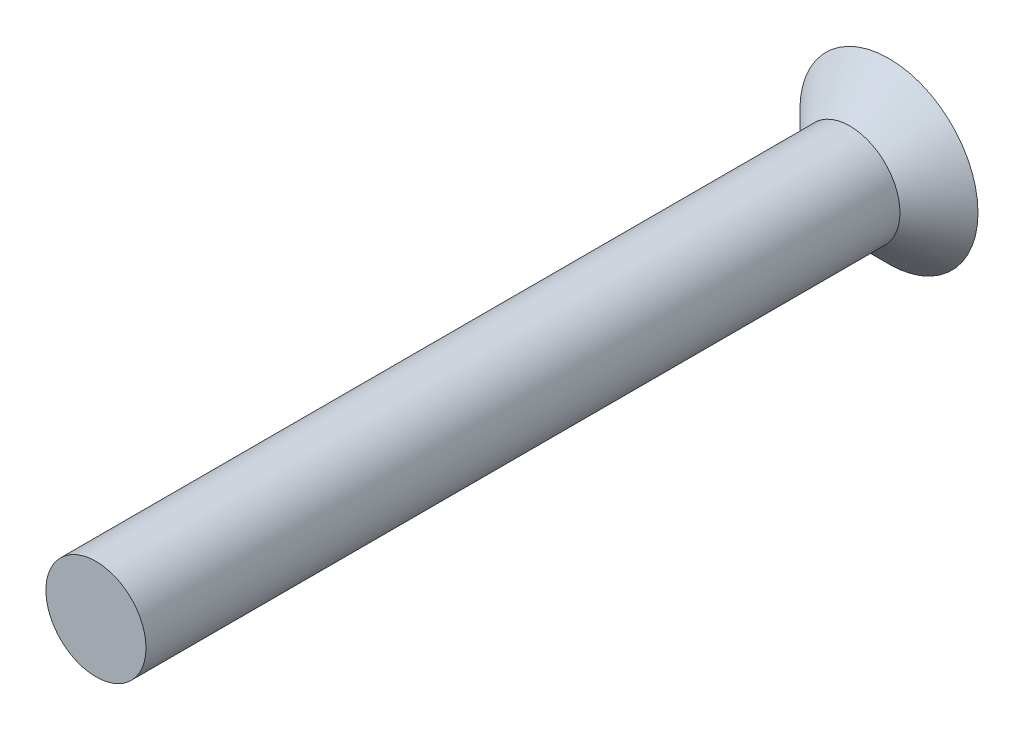
ISO-10303-21;
HEADER;
FILE_DESCRIPTION(('STEP AP214'),'2;1');
FILE_NAME('part.step','',(''),(''),'','','');
FILE_SCHEMA(('AUTOMOTIVE_DESIGN { 1 0 10303 214 1 1 1 1 }'));
ENDSEC;
DATA;
#1=APPLICATION_CONTEXT('core data for automotive mechanical design processes');
#2=APPLICATION_PROTOCOL_DEFINITION('international standard','automotive_design',2000,#1);
#3=PRODUCT_CONTEXT('',#1,'mechanical');
#4=PRODUCT('Part','Part','',(#3));
#5=PRODUCT_RELATED_PRODUCT_CATEGORY('part','',(#4));
#6=PRODUCT_DEFINITION_FORMATION('','',#4);
#7=PRODUCT_DEFINITION_CONTEXT('part definition',#1,'design');
#8=PRODUCT_DEFINITION('design','',#6,#7);
#9=PRODUCT_DEFINITION_SHAPE('','',#8);
#10=(LENGTH_UNIT() NAMED_UNIT(*) SI_UNIT(.MILLI.,.METRE.));
#11=(NAMED_UNIT(*) PLANE_ANGLE_UNIT() SI_UNIT($,.RADIAN.));
#12=(NAMED_UNIT(*) SI_UNIT($,.STERADIAN.) SOLID_ANGLE_UNIT());
#13=UNCERTAINTY_MEASURE_WITH_UNIT(LENGTH_MEASURE(1.E-05),#10,'distance_accuracy_value','');
#14=(GEOMETRIC_REPRESENTATION_CONTEXT(3) GLOBAL_UNCERTAINTY_ASSIGNED_CONTEXT((#13)) GLOBAL_UNIT_ASSIGNED_CONTEXT((#10,
#11,#12)) REPRESENTATION_CONTEXT('',''));
#15=CARTESIAN_POINT('',(0.,0.,0.));
#16=DIRECTION('',(0.,0.,1.));
#17=DIRECTION('',(1.,0.,0.));
#18=AXIS2_PLACEMENT_3D('',#15,#16,#17);
#19=CARTESIAN_POINT('',(15.5,-15.5,-19.2208));
#20=DIRECTION('',(0.,0.,1.));
#21=DIRECTION('',(1.,0.,0.));
#22=AXIS2_PLACEMENT_3D('',#19,#20,#21);
#23=PLANE('',#22);
#24=CARTESIAN_POINT('',(14.7888,-16.2112,-19.2208));
#25=DIRECTION('',(0.,0.,1.));
#26=DIRECTION('',(1.,0.,0.));
#27=AXIS2_PLACEMENT_3D('',#24,#25,#26);
#28=CIRCLE('',#27,0.508);
#29=CARTESIAN_POINT('',(15.0174,-15.7575414940729,-19.2208));
#30=VERTEX_POINT('',#29);
#31=CARTESIAN_POINT('',(15.2424585059271,-15.9826,-19.2208));
#32=VERTEX_POINT('',#31);
#33=EDGE_CURVE('E188',#30,#32,#28,.F.);
#34=ORIENTED_EDGE('',*,*,#33,.F.);
#35=DIRECTION('',(0.,1.,0.));
#36=VECTOR('',#35,1.);
#37=CARTESIAN_POINT('',(15.0174,-15.5,-19.2208));
#38=LINE('',#37,#36);
#39=CARTESIAN_POINT('',(15.0174,-15.2424585059271,-19.2208));
#40=VERTEX_POINT('',#39);
#41=EDGE_CURVE('E209',#30,#40,#38,.T.);
#42=ORIENTED_EDGE('',*,*,#41,.T.);
#43=CARTESIAN_POINT('',(14.7888,-14.7888,-19.2208));
#44=DIRECTION('',(0.,0.,-1.));
#45=DIRECTION('',(-1.,0.,0.));
#46=AXIS2_PLACEMENT_3D('',#43,#44,#45);
#47=CIRCLE('',#46,0.508);
#48=CARTESIAN_POINT('',(15.2424585059271,-15.0174,-19.2208));
#49=VERTEX_POINT('',#48);
#50=EDGE_CURVE('E213',#49,#40,#47,.T.);
#51=ORIENTED_EDGE('',*,*,#50,.F.);
#52=DIRECTION('',(1.,0.,0.));
#53=VECTOR('',#52,1.);
#54=CARTESIAN_POINT('',(15.5,-15.0174,-19.2208));
#55=LINE('',#54,#53);
#56=CARTESIAN_POINT('',(15.7575414940729,-15.0174,-19.2208));
#57=VERTEX_POINT('',#56);
#58=EDGE_CURVE('E135',#49,#57,#55,.T.);
#59=ORIENTED_EDGE('',*,*,#58,.T.);
#60=CARTESIAN_POINT('',(16.2112,-14.7888,-19.2208));
#61=DIRECTION('',(0.,0.,1.));
#62=DIRECTION('',(1.,0.,0.));
#63=AXIS2_PLACEMENT_3D('',#60,#61,#62);
#64=CIRCLE('',#63,0.508);
#65=CARTESIAN_POINT('',(15.9826,-15.2424585059271,-19.2208));
#66=VERTEX_POINT('',#65);
#67=EDGE_CURVE('E20',#66,#57,#64,.F.);
#68=ORIENTED_EDGE('',*,*,#67,.F.);
#69=DIRECTION('',(0.,1.,0.));
#70=VECTOR('',#69,1.);
#71=CARTESIAN_POINT('',(15.9826,-15.5,-19.2208));
#72=LINE('',#71,#70);
#73=CARTESIAN_POINT('',(15.9826,-15.7575414940729,-19.2208));
#74=VERTEX_POINT('',#73);
#75=EDGE_CURVE('E132',#66,#74,#72,.F.);
#76=ORIENTED_EDGE('',*,*,#75,.T.);
#77=CARTESIAN_POINT('',(16.2112,-16.2112,-19.2208));
#78=DIRECTION('',(0.,0.,-1.));
#79=DIRECTION('',(-1.,0.,0.));
#80=AXIS2_PLACEMENT_3D('',#77,#78,#79);
#81=CIRCLE('',#80,0.508);
#82=CARTESIAN_POINT('',(15.7575414940729,-15.9826,-19.2208));
#83=VERTEX_POINT('',#82);
#84=EDGE_CURVE('E161',#83,#74,#81,.T.);
#85=ORIENTED_EDGE('',*,*,#84,.F.);
#86=DIRECTION('',(1.,0.,0.));
#87=VECTOR('',#86,1.);
#88=CARTESIAN_POINT('',(15.5,-15.9826,-19.2208));
#89=LINE('',#88,#87);
#90=EDGE_CURVE('E168',#83,#32,#89,.F.);
#91=ORIENTED_EDGE('',*,*,#90,.T.);
#92=EDGE_LOOP('',(#34,#42,#51,#59,#68,#76,#85,#91));
#93=FACE_BOUND('',#92,.T.);
#94=ADVANCED_FACE('F17',(#93),#23,.F.);
#95=CARTESIAN_POINT('',(16.2112,-14.7888,-19.8520736083459));
#96=DIRECTION('',(0.,0.,1.));
#97=DIRECTION('',(1.,0.,0.));
#98=AXIS2_PLACEMENT_3D('',#95,#96,#97);
#99=CYLINDRICAL_SURFACE('',#98,0.508);
#100=CARTESIAN_POINT('',(16.2112,-14.7888,-19.4266323645265));
#101=DIRECTION('',(0.669130606358859,0.,0.743144825477394));
#102=DIRECTION('',(-0.743144825477394,0.,0.669130606358859));
#103=AXIS2_PLACEMENT_3D('',#100,#101,#102);
#104=ELLIPSE('',#103,0.683581426640039,0.508);
#105=CARTESIAN_POINT('',(16.2112,-15.2968,-19.4266323645265));
#106=VERTEX_POINT('',#105);
#107=EDGE_CURVE('E140',#106,#66,#104,.F.);
#108=ORIENTED_EDGE('',*,*,#107,.T.);
#109=ORIENTED_EDGE('',*,*,#67,.T.);
#110=CARTESIAN_POINT('',(16.2112,-14.7888,-19.4266323645265));
#111=DIRECTION('',(0.,0.669130606358859,0.743144825477394));
#112=DIRECTION('',(0.,-0.743144825477394,0.669130606358859));
#113=AXIS2_PLACEMENT_3D('',#110,#111,#112);
#114=ELLIPSE('',#113,0.683581426640039,0.508);
#115=CARTESIAN_POINT('',(15.7032,-14.7888,-19.4266323645265));
#116=VERTEX_POINT('',#115);
#117=EDGE_CURVE('E231',#57,#116,#114,.F.);
#118=ORIENTED_EDGE('',*,*,#117,.T.);
#119=DIRECTION('',(0.,0.,1.));
#120=VECTOR('',#119,1.);
#121=CARTESIAN_POINT('',(15.7032,-14.7888,-19.8520736083459));
#122=LINE('',#121,#120);
#123=CARTESIAN_POINT('',(15.7032,-14.7888,-20.186));
#124=VERTEX_POINT('',#123);
#125=EDGE_CURVE('E138',#116,#124,#122,.F.);
#126=ORIENTED_EDGE('',*,*,#125,.T.);
#127=CARTESIAN_POINT('',(16.2112,-14.7888,-20.186));
#128=DIRECTION('',(0.,0.,1.));
#129=DIRECTION('',(1.,0.,0.));
#130=AXIS2_PLACEMENT_3D('',#127,#128,#129);
#131=CIRCLE('',#130,0.508);
#132=CARTESIAN_POINT('',(16.2112,-15.2968,-20.186));
#133=VERTEX_POINT('',#132);
#134=EDGE_CURVE('E252',#133,#124,#131,.F.);
#135=ORIENTED_EDGE('',*,*,#134,.F.);
#136=DIRECTION('',(0.,0.,1.));
#137=VECTOR('',#136,1.);
#138=CARTESIAN_POINT('',(16.2112,-15.2968,-19.8520736083459));
#139=LINE('',#138,#137);
#140=EDGE_CURVE('E143',#133,#106,#139,.T.);
#141=ORIENTED_EDGE('',*,*,#140,.T.);
#142=EDGE_LOOP('',(#108,#109,#118,#126,#135,#141));
#143=FACE_BOUND('',#142,.T.);
#144=ADVANCED_FACE('F141',(#143),#99,.T.);
#145=CARTESIAN_POINT('',(15.7032,-15.5,-19.8520736083459));
#146=DIRECTION('',(1.,0.,0.));
#147=DIRECTION('',(0.,1.,0.));
#148=AXIS2_PLACEMENT_3D('',#145,#146,#147);
#149=PLANE('',#148);
#150=DIRECTION('',(0.,-0.743144825477394,0.669130606358859));
#151=VECTOR('',#150,1.);
#152=CARTESIAN_POINT('',(15.7032,-13.9454368006869,-20.186));
#153=LINE('',#152,#151);
#154=CARTESIAN_POINT('',(15.7032,-13.9454368006869,-20.186));
#155=VERTEX_POINT('',#154);
#156=EDGE_CURVE('E220',#116,#155,#153,.F.);
#157=ORIENTED_EDGE('',*,*,#156,.T.);
#158=DIRECTION('',(0.,1.,0.));
#159=VECTOR('',#158,1.);
#160=CARTESIAN_POINT('',(15.7032,-15.5,-20.186));
#161=LINE('',#160,#159);
#162=EDGE_CURVE('E227',#124,#155,#161,.T.);
#163=ORIENTED_EDGE('',*,*,#162,.F.);
#164=ORIENTED_EDGE('',*,*,#125,.F.);
#165=EDGE_LOOP('',(#157,#163,#164));
#166=FACE_BOUND('',#165,.T.);
#167=ADVANCED_FACE('F272',(#166),#149,.F.);
#168=CARTESIAN_POINT('',(15.5,-13.9454368006869,-20.186));
#169=DIRECTION('',(0.,0.669130606358859,0.743144825477394));
#170=DIRECTION('',(0.,-0.743144825477394,0.669130606358859));
#171=AXIS2_PLACEMENT_3D('',#168,#169,#170);
#172=PLANE('',#171);
#173=DIRECTION('',(-1.,0.,0.));
#174=VECTOR('',#173,1.);
#175=CARTESIAN_POINT('',(15.5,-13.9454368006869,-20.186));
#176=LINE('',#175,#174);
#177=CARTESIAN_POINT('',(15.2968,-13.9454368006869,-20.186));
#178=VERTEX_POINT('',#177);
#179=EDGE_CURVE('E223',#155,#178,#176,.T.);
#180=ORIENTED_EDGE('',*,*,#179,.F.);
#181=ORIENTED_EDGE('',*,*,#156,.F.);
#182=ORIENTED_EDGE('',*,*,#117,.F.);
#183=ORIENTED_EDGE('',*,*,#58,.F.);
#184=CARTESIAN_POINT('',(14.7888,-14.7888,-19.4266323645265));
#185=DIRECTION('',(0.,0.669130606358859,0.743144825477394));
#186=DIRECTION('',(0.,0.743144825477394,-0.669130606358859));
#187=AXIS2_PLACEMENT_3D('',#184,#185,#186);
#188=ELLIPSE('',#187,0.683581426640039,0.508);
#189=CARTESIAN_POINT('',(15.2968,-14.7888,-19.4266323645265));
#190=VERTEX_POINT('',#189);
#191=EDGE_CURVE('E217',#190,#49,#188,.F.);
#192=ORIENTED_EDGE('',*,*,#191,.F.);
#193=DIRECTION('',(0.,-0.743144825477387,0.669130606358866));
#194=VECTOR('',#193,1.);
#195=CARTESIAN_POINT('',(15.2968,-13.9454368006869,-20.186));
#196=LINE('',#195,#194);
#197=EDGE_CURVE('E218',#178,#190,#196,.T.);
#198=ORIENTED_EDGE('',*,*,#197,.F.);
#199=EDGE_LOOP('',(#180,#181,#182,#183,#192,#198));
#200=FACE_BOUND('',#199,.T.);
#201=ADVANCED_FACE('F275',(#200),#172,.F.);
#202=CARTESIAN_POINT('',(15.2968,-15.5,-19.8520736083459));
#203=DIRECTION('',(1.,0.,0.));
#204=DIRECTION('',(0.,1.,0.));
#205=AXIS2_PLACEMENT_3D('',#202,#203,#204);
#206=PLANE('',#205);
#207=DIRECTION('',(0.,1.,0.));
#208=VECTOR('',#207,1.);
#209=CARTESIAN_POINT('',(15.2968,-15.5,-20.186));
#210=LINE('',#209,#208);
#211=CARTESIAN_POINT('',(15.2968,-14.7888,-20.186));
#212=VERTEX_POINT('',#211);
#213=EDGE_CURVE('E226',#178,#212,#210,.F.);
#214=ORIENTED_EDGE('',*,*,#213,.F.);
#215=ORIENTED_EDGE('',*,*,#197,.T.);
#216=DIRECTION('',(0.,0.,-1.));
#217=VECTOR('',#216,1.);
#218=CARTESIAN_POINT('',(15.2968,-14.7888,-19.8520736083459));
#219=LINE('',#218,#217);
#220=EDGE_CURVE('E214',#212,#190,#219,.F.);
#221=ORIENTED_EDGE('',*,*,#220,.F.);
#222=EDGE_LOOP('',(#214,#215,#221));
#223=FACE_BOUND('',#222,.T.);
#224=ADVANCED_FACE('F320',(#223),#206,.T.);
#225=CARTESIAN_POINT('',(14.7888,-14.7888,-19.8520736083459));
#226=DIRECTION('',(0.,0.,-1.));
#227=DIRECTION('',(-1.,0.,0.));
#228=AXIS2_PLACEMENT_3D('',#225,#226,#227);
#229=CYLINDRICAL_SURFACE('',#228,0.508);
#230=CARTESIAN_POINT('',(14.7888,-14.7888,-19.4266323645265));
#231=DIRECTION('',(-0.669130606358859,0.,0.743144825477394));
#232=DIRECTION('',(-0.743144825477394,0.,-0.669130606358859));
#233=AXIS2_PLACEMENT_3D('',#230,#231,#232);
#234=ELLIPSE('',#233,0.683581426640039,0.508);
#235=CARTESIAN_POINT('',(14.7888,-15.2968,-19.4266323645265));
#236=VERTEX_POINT('',#235);
#237=EDGE_CURVE('E206',#40,#236,#234,.F.);
#238=ORIENTED_EDGE('',*,*,#237,.T.);
#239=DIRECTION('',(0.,0.,1.));
#240=VECTOR('',#239,1.);
#241=CARTESIAN_POINT('',(14.7888,-15.2968,-19.8520736083459));
#242=LINE('',#241,#240);
#243=CARTESIAN_POINT('',(14.7888,-15.2968,-20.186));
#244=VERTEX_POINT('',#243);
#245=EDGE_CURVE('E211',#236,#244,#242,.F.);
#246=ORIENTED_EDGE('',*,*,#245,.T.);
#247=CARTESIAN_POINT('',(14.7888,-14.7888,-20.186));
#248=DIRECTION('',(0.,0.,-1.));
#249=DIRECTION('',(-1.,0.,0.));
#250=AXIS2_PLACEMENT_3D('',#247,#248,#249);
#251=CIRCLE('',#250,0.508);
#252=EDGE_CURVE('E249',#212,#244,#251,.T.);
#253=ORIENTED_EDGE('',*,*,#252,.F.);
#254=ORIENTED_EDGE('',*,*,#220,.T.);
#255=ORIENTED_EDGE('',*,*,#191,.T.);
#256=ORIENTED_EDGE('',*,*,#50,.T.);
#257=EDGE_LOOP('',(#238,#246,#253,#254,#255,#256));
#258=FACE_BOUND('',#257,.T.);
#259=ADVANCED_FACE('F322',(#258),#229,.T.);
#260=CARTESIAN_POINT('',(15.5,-15.2968,-19.8520736083459));
#261=DIRECTION('',(0.,1.,0.));
#262=DIRECTION('',(-1.,0.,0.));
#263=AXIS2_PLACEMENT_3D('',#260,#261,#262);
#264=PLANE('',#263);
#265=DIRECTION('',(0.743144825477394,0.,0.669130606358859));
#266=VECTOR('',#265,1.);
#267=CARTESIAN_POINT('',(13.9454368006869,-15.2968,-20.186));
#268=LINE('',#267,#266);
#269=CARTESIAN_POINT('',(13.9454368006869,-15.2968,-20.186));
#270=VERTEX_POINT('',#269);
#271=EDGE_CURVE('E195',#236,#270,#268,.F.);
#272=ORIENTED_EDGE('',*,*,#271,.T.);
#273=DIRECTION('',(-1.,0.,0.));
#274=VECTOR('',#273,1.);
#275=CARTESIAN_POINT('',(15.5,-15.2968,-20.186));
#276=LINE('',#275,#274);
#277=EDGE_CURVE('E202',#244,#270,#276,.T.);
#278=ORIENTED_EDGE('',*,*,#277,.F.);
#279=ORIENTED_EDGE('',*,*,#245,.F.);
#280=EDGE_LOOP('',(#272,#278,#279));
#281=FACE_BOUND('',#280,.T.);
#282=ADVANCED_FACE('F328',(#281),#264,.F.);
#283=CARTESIAN_POINT('',(13.9454368006869,-15.5,-20.186));
#284=DIRECTION('',(-0.669130606358859,0.,0.743144825477394));
#285=DIRECTION('',(0.743144825477394,0.,0.669130606358859));
#286=AXIS2_PLACEMENT_3D('',#283,#284,#285);
#287=PLANE('',#286);
#288=DIRECTION('',(0.,1.,0.));
#289=VECTOR('',#288,1.);
#290=CARTESIAN_POINT('',(13.9454368006869,-15.5,-20.186));
#291=LINE('',#290,#289);
#292=CARTESIAN_POINT('',(13.9454368006869,-15.7032,-20.186));
#293=VERTEX_POINT('',#292);
#294=EDGE_CURVE('E198',#270,#293,#291,.F.);
#295=ORIENTED_EDGE('',*,*,#294,.F.);
#296=ORIENTED_EDGE('',*,*,#271,.F.);
#297=ORIENTED_EDGE('',*,*,#237,.F.);
#298=ORIENTED_EDGE('',*,*,#41,.F.);
#299=CARTESIAN_POINT('',(14.7888,-16.2112,-19.4266323645265));
#300=DIRECTION('',(-0.669130606358859,0.,0.743144825477394));
#301=DIRECTION('',(0.743144825477394,0.,0.669130606358859));
#302=AXIS2_PLACEMENT_3D('',#299,#300,#301);
#303=ELLIPSE('',#302,0.683581426640039,0.508);
#304=CARTESIAN_POINT('',(14.7888,-15.7032,-19.4266323645265));
#305=VERTEX_POINT('',#304);
#306=EDGE_CURVE('E192',#305,#30,#303,.F.);
#307=ORIENTED_EDGE('',*,*,#306,.F.);
#308=DIRECTION('',(0.743144825477387,0.,0.669130606358866));
#309=VECTOR('',#308,1.);
#310=CARTESIAN_POINT('',(13.9454368006869,-15.7032,-20.186));
#311=LINE('',#310,#309);
#312=EDGE_CURVE('E193',#293,#305,#311,.T.);
#313=ORIENTED_EDGE('',*,*,#312,.F.);
#314=EDGE_LOOP('',(#295,#296,#297,#298,#307,#313));
#315=FACE_BOUND('',#314,.T.);
#316=ADVANCED_FACE('F332',(#315),#287,.F.);
#317=CARTESIAN_POINT('',(15.5,-15.7032,-19.8520736083459));
#318=DIRECTION('',(0.,1.,0.));
#319=DIRECTION('',(-1.,0.,0.));
#320=AXIS2_PLACEMENT_3D('',#317,#318,#319);
#321=PLANE('',#320);
#322=DIRECTION('',(-1.,0.,0.));
#323=VECTOR('',#322,1.);
#324=CARTESIAN_POINT('',(15.5,-15.7032,-20.186));
#325=LINE('',#324,#323);
#326=CARTESIAN_POINT('',(14.7888,-15.7032,-20.186));
#327=VERTEX_POINT('',#326);
#328=EDGE_CURVE('E201',#293,#327,#325,.F.);
#329=ORIENTED_EDGE('',*,*,#328,.F.);
#330=ORIENTED_EDGE('',*,*,#312,.T.);
#331=DIRECTION('',(0.,0.,1.));
#332=VECTOR('',#331,1.);
#333=CARTESIAN_POINT('',(14.7888,-15.7032,-19.8520736083459));
#334=LINE('',#333,#332);
#335=EDGE_CURVE('E189',#327,#305,#334,.T.);
#336=ORIENTED_EDGE('',*,*,#335,.F.);
#337=EDGE_LOOP('',(#329,#330,#336));
#338=FACE_BOUND('',#337,.T.);
#339=ADVANCED_FACE('F335',(#338),#321,.T.);
#340=CARTESIAN_POINT('',(14.7888,-16.2112,-19.8520736083459));
#341=DIRECTION('',(0.,0.,1.));
#342=DIRECTION('',(1.,0.,0.));
#343=AXIS2_PLACEMENT_3D('',#340,#341,#342);
#344=CYLINDRICAL_SURFACE('',#343,0.508);
#345=ORIENTED_EDGE('',*,*,#306,.T.);
#346=ORIENTED_EDGE('',*,*,#33,.T.);
#347=CARTESIAN_POINT('',(14.7888,-16.2112,-19.4266323645265));
#348=DIRECTION('',(0.,-0.669130606358859,0.743144825477394));
#349=DIRECTION('',(0.,0.743144825477394,0.669130606358859));
#350=AXIS2_PLACEMENT_3D('',#347,#348,#349);
#351=ELLIPSE('',#350,0.683581426640039,0.508);
#352=CARTESIAN_POINT('',(15.2968,-16.2112,-19.4266323645265));
#353=VERTEX_POINT('',#352);
#354=EDGE_CURVE('E182',#32,#353,#351,.F.);
#355=ORIENTED_EDGE('',*,*,#354,.T.);
#356=DIRECTION('',(0.,0.,1.));
#357=VECTOR('',#356,1.);
#358=CARTESIAN_POINT('',(15.2968,-16.2112,-19.8520736083459));
#359=LINE('',#358,#357);
#360=CARTESIAN_POINT('',(15.2968,-16.2112,-20.186));
#361=VERTEX_POINT('',#360);
#362=EDGE_CURVE('E185',#361,#353,#359,.T.);
#363=ORIENTED_EDGE('',*,*,#362,.F.);
#364=CARTESIAN_POINT('',(14.7888,-16.2112,-20.186));
#365=DIRECTION('',(0.,0.,1.));
#366=DIRECTION('',(1.,0.,0.));
#367=AXIS2_PLACEMENT_3D('',#364,#365,#366);
#368=CIRCLE('',#367,0.508);
#369=EDGE_CURVE('E246',#327,#361,#368,.F.);
#370=ORIENTED_EDGE('',*,*,#369,.F.);
#371=ORIENTED_EDGE('',*,*,#335,.T.);
#372=EDGE_LOOP('',(#345,#346,#355,#363,#370,#371));
#373=FACE_BOUND('',#372,.T.);
#374=ADVANCED_FACE('F338',(#373),#344,.T.);
#375=CARTESIAN_POINT('',(15.2968,-15.5,-19.8520736083459));
#376=DIRECTION('',(1.,0.,0.));
#377=DIRECTION('',(0.,1.,0.));
#378=AXIS2_PLACEMENT_3D('',#375,#376,#377);
#379=PLANE('',#378);
#380=DIRECTION('',(0.,-0.743144825477394,-0.669130606358859));
#381=VECTOR('',#380,1.);
#382=CARTESIAN_POINT('',(15.2968,-15.9826,-19.2208));
#383=LINE('',#382,#381);
#384=CARTESIAN_POINT('',(15.2968,-17.0545631993132,-20.186));
#385=VERTEX_POINT('',#384);
#386=EDGE_CURVE('E180',#353,#385,#383,.T.);
#387=ORIENTED_EDGE('',*,*,#386,.T.);
#388=DIRECTION('',(0.,1.,0.));
#389=VECTOR('',#388,1.);
#390=CARTESIAN_POINT('',(15.2968,-15.5,-20.186));
#391=LINE('',#390,#389);
#392=EDGE_CURVE('E175',#361,#385,#391,.F.);
#393=ORIENTED_EDGE('',*,*,#392,.F.);
#394=ORIENTED_EDGE('',*,*,#362,.T.);
#395=EDGE_LOOP('',(#387,#393,#394));
#396=FACE_BOUND('',#395,.T.);
#397=ADVANCED_FACE('F342',(#396),#379,.T.);
#398=CARTESIAN_POINT('',(15.5,-15.9826,-19.2208));
#399=DIRECTION('',(0.,-0.669130606358859,0.743144825477394));
#400=DIRECTION('',(0.,-0.743144825477394,-0.669130606358859));
#401=AXIS2_PLACEMENT_3D('',#398,#399,#400);
#402=PLANE('',#401);
#403=CARTESIAN_POINT('',(16.2112,-16.2112,-19.4266323645265));
#404=DIRECTION('',(0.,-0.669130606358859,0.743144825477394));
#405=DIRECTION('',(0.,-0.743144825477394,-0.669130606358859));
#406=AXIS2_PLACEMENT_3D('',#403,#404,#405);
#407=ELLIPSE('',#406,0.683581426640039,0.508);
#408=CARTESIAN_POINT('',(15.7032,-16.2112,-19.4266323645265));
#409=VERTEX_POINT('',#408);
#410=EDGE_CURVE('E165',#409,#83,#407,.F.);
#411=ORIENTED_EDGE('',*,*,#410,.F.);
#412=DIRECTION('',(0.,-0.743144825477426,-0.669130606358824));
#413=VECTOR('',#412,1.);
#414=CARTESIAN_POINT('',(15.7032,-16.2112,-19.4266323645265));
#415=LINE('',#414,#413);
#416=CARTESIAN_POINT('',(15.7032,-17.0545631993132,-20.186));
#417=VERTEX_POINT('',#416);
#418=EDGE_CURVE('E166',#409,#417,#415,.T.);
#419=ORIENTED_EDGE('',*,*,#418,.T.);
#420=DIRECTION('',(-1.,0.,0.));
#421=VECTOR('',#420,1.);
#422=CARTESIAN_POINT('',(15.5,-17.0545631993132,-20.186));
#423=LINE('',#422,#421);
#424=EDGE_CURVE('E171',#385,#417,#423,.F.);
#425=ORIENTED_EDGE('',*,*,#424,.F.);
#426=ORIENTED_EDGE('',*,*,#386,.F.);
#427=ORIENTED_EDGE('',*,*,#354,.F.);
#428=ORIENTED_EDGE('',*,*,#90,.F.);
#429=EDGE_LOOP('',(#411,#419,#425,#426,#427,#428));
#430=FACE_BOUND('',#429,.T.);
#431=ADVANCED_FACE('F347',(#430),#402,.F.);
#432=CARTESIAN_POINT('',(15.7032,-15.5,-19.8520736083459));
#433=DIRECTION('',(1.,0.,0.));
#434=DIRECTION('',(0.,1.,0.));
#435=AXIS2_PLACEMENT_3D('',#432,#433,#434);
#436=PLANE('',#435);
#437=DIRECTION('',(0.,1.,0.));
#438=VECTOR('',#437,1.);
#439=CARTESIAN_POINT('',(15.7032,-15.5,-20.186));
#440=LINE('',#439,#438);
#441=CARTESIAN_POINT('',(15.7032,-16.2112,-20.186));
#442=VERTEX_POINT('',#441);
#443=EDGE_CURVE('E174',#417,#442,#440,.T.);
#444=ORIENTED_EDGE('',*,*,#443,.F.);
#445=ORIENTED_EDGE('',*,*,#418,.F.);
#446=DIRECTION('',(0.,0.,-1.));
#447=VECTOR('',#446,1.);
#448=CARTESIAN_POINT('',(15.7032,-16.2112,-19.8520736083459));
#449=LINE('',#448,#447);
#450=EDGE_CURVE('E162',#442,#409,#449,.F.);
#451=ORIENTED_EDGE('',*,*,#450,.F.);
#452=EDGE_LOOP('',(#444,#445,#451));
#453=FACE_BOUND('',#452,.T.);
#454=ADVANCED_FACE('F350',(#453),#436,.F.);
#455=CARTESIAN_POINT('',(16.2112,-16.2112,-19.8520736083459));
#456=DIRECTION('',(0.,0.,-1.));
#457=DIRECTION('',(-1.,0.,0.));
#458=AXIS2_PLACEMENT_3D('',#455,#456,#457);
#459=CYLINDRICAL_SURFACE('',#458,0.508);
#460=CARTESIAN_POINT('',(16.2112,-16.2112,-19.4266323645265));
#461=DIRECTION('',(0.669130606358859,0.,0.743144825477394));
#462=DIRECTION('',(0.743144825477394,0.,-0.669130606358859));
#463=AXIS2_PLACEMENT_3D('',#460,#461,#462);
#464=ELLIPSE('',#463,0.683581426640039,0.508);
#465=CARTESIAN_POINT('',(16.2112,-15.7032,-19.4266323645265));
#466=VERTEX_POINT('',#465);
#467=EDGE_CURVE('E148',#74,#466,#464,.F.);
#468=ORIENTED_EDGE('',*,*,#467,.T.);
#469=DIRECTION('',(0.,0.,1.));
#470=VECTOR('',#469,1.);
#471=CARTESIAN_POINT('',(16.2112,-15.7032,-19.8520736083459));
#472=LINE('',#471,#470);
#473=CARTESIAN_POINT('',(16.2112,-15.7032,-20.186));
#474=VERTEX_POINT('',#473);
#475=EDGE_CURVE('E158',#474,#466,#472,.T.);
#476=ORIENTED_EDGE('',*,*,#475,.F.);
#477=CARTESIAN_POINT('',(16.2112,-16.2112,-20.186));
#478=DIRECTION('',(0.,0.,-1.));
#479=DIRECTION('',(-1.,0.,0.));
#480=AXIS2_PLACEMENT_3D('',#477,#478,#479);
#481=CIRCLE('',#480,0.508);
#482=EDGE_CURVE('E242',#442,#474,#481,.T.);
#483=ORIENTED_EDGE('',*,*,#482,.F.);
#484=ORIENTED_EDGE('',*,*,#450,.T.);
#485=ORIENTED_EDGE('',*,*,#410,.T.);
#486=ORIENTED_EDGE('',*,*,#84,.T.);
#487=EDGE_LOOP('',(#468,#476,#483,#484,#485,#486));
#488=FACE_BOUND('',#487,.T.);
#489=ADVANCED_FACE('F353',(#488),#459,.T.);
#490=CARTESIAN_POINT('',(15.5,-15.7032,-19.8520736083459));
#491=DIRECTION('',(0.,1.,0.));
#492=DIRECTION('',(-1.,0.,0.));
#493=AXIS2_PLACEMENT_3D('',#490,#491,#492);
#494=PLANE('',#493);
#495=DIRECTION('',(0.743144825477394,0.,-0.669130606358859));
#496=VECTOR('',#495,1.);
#497=CARTESIAN_POINT('',(15.9826,-15.7032,-19.2208));
#498=LINE('',#497,#496);
#499=CARTESIAN_POINT('',(17.0545631993132,-15.7032,-20.186));
#500=VERTEX_POINT('',#499);
#501=EDGE_CURVE('E144',#466,#500,#498,.T.);
#502=ORIENTED_EDGE('',*,*,#501,.T.);
#503=DIRECTION('',(-1.,0.,0.));
#504=VECTOR('',#503,1.);
#505=CARTESIAN_POINT('',(15.5,-15.7032,-20.186));
#506=LINE('',#505,#504);
#507=EDGE_CURVE('E245',#474,#500,#506,.F.);
#508=ORIENTED_EDGE('',*,*,#507,.F.);
#509=ORIENTED_EDGE('',*,*,#475,.T.);
#510=EDGE_LOOP('',(#502,#508,#509));
#511=FACE_BOUND('',#510,.T.);
#512=ADVANCED_FACE('F355',(#511),#494,.T.);
#513=CARTESIAN_POINT('',(15.9826,-15.5,-19.2208));
#514=DIRECTION('',(0.669130606358859,0.,0.743144825477394));
#515=DIRECTION('',(0.743144825477394,0.,-0.669130606358859));
#516=AXIS2_PLACEMENT_3D('',#513,#514,#515);
#517=PLANE('',#516);
#518=ORIENTED_EDGE('',*,*,#107,.F.);
#519=DIRECTION('',(0.743144825477426,0.,-0.669130606358824));
#520=VECTOR('',#519,1.);
#521=CARTESIAN_POINT('',(16.2112,-15.2968,-19.4266323645265));
#522=LINE('',#521,#520);
#523=CARTESIAN_POINT('',(17.0545631993132,-15.2968,-20.186));
#524=VERTEX_POINT('',#523);
#525=EDGE_CURVE('E35',#106,#524,#522,.T.);
#526=ORIENTED_EDGE('',*,*,#525,.T.);
#527=DIRECTION('',(0.,1.,0.));
#528=VECTOR('',#527,1.);
#529=CARTESIAN_POINT('',(17.0545631993132,-15.5,-20.186));
#530=LINE('',#529,#528);
#531=EDGE_CURVE('E293',#500,#524,#530,.T.);
#532=ORIENTED_EDGE('',*,*,#531,.F.);
#533=ORIENTED_EDGE('',*,*,#501,.F.);
#534=ORIENTED_EDGE('',*,*,#467,.F.);
#535=ORIENTED_EDGE('',*,*,#75,.F.);
#536=EDGE_LOOP('',(#518,#526,#532,#533,#534,#535));
#537=FACE_BOUND('',#536,.T.);
#538=ADVANCED_FACE('F146',(#537),#517,.F.);
#539=CARTESIAN_POINT('',(15.5,-15.2968,-19.8520736083459));
#540=DIRECTION('',(0.,1.,0.));
#541=DIRECTION('',(-1.,0.,0.));
#542=AXIS2_PLACEMENT_3D('',#539,#540,#541);
#543=PLANE('',#542);
#544=DIRECTION('',(-1.,0.,0.));
#545=VECTOR('',#544,1.);
#546=CARTESIAN_POINT('',(15.5,-15.2968,-20.186));
#547=LINE('',#546,#545);
#548=EDGE_CURVE('E241',#524,#133,#547,.T.);
#549=ORIENTED_EDGE('',*,*,#548,.F.);
#550=ORIENTED_EDGE('',*,*,#525,.F.);
#551=ORIENTED_EDGE('',*,*,#140,.F.);
#552=EDGE_LOOP('',(#549,#550,#551));
#553=FACE_BOUND('',#552,.T.);
#554=ADVANCED_FACE('F363',(#553),#543,.F.);
#555=CARTESIAN_POINT('',(15.5,-15.5,-20.186));
#556=DIRECTION('',(0.,0.,-1.));
#557=DIRECTION('',(-1.,0.,0.));
#558=AXIS2_PLACEMENT_3D('',#555,#556,#557);
#559=PLANE('',#558);
#560=ORIENTED_EDGE('',*,*,#531,.T.);
#561=ORIENTED_EDGE('',*,*,#548,.T.);
#562=ORIENTED_EDGE('',*,*,#134,.T.);
#563=ORIENTED_EDGE('',*,*,#162,.T.);
#564=ORIENTED_EDGE('',*,*,#179,.T.);
#565=ORIENTED_EDGE('',*,*,#213,.T.);
#566=ORIENTED_EDGE('',*,*,#252,.T.);
#567=ORIENTED_EDGE('',*,*,#277,.T.);
#568=ORIENTED_EDGE('',*,*,#294,.T.);
#569=ORIENTED_EDGE('',*,*,#328,.T.);
#570=ORIENTED_EDGE('',*,*,#369,.T.);
#571=ORIENTED_EDGE('',*,*,#392,.T.);
#572=ORIENTED_EDGE('',*,*,#424,.T.);
#573=ORIENTED_EDGE('',*,*,#443,.T.);
#574=ORIENTED_EDGE('',*,*,#482,.T.);
#575=ORIENTED_EDGE('',*,*,#507,.T.);
#576=EDGE_LOOP('',(#560,#561,#562,#563,#564,#565,#566,#567,#568,#569,#570,#571,#572,#573,#574,#575));
#577=FACE_BOUND('',#576,.T.);
#578=CARTESIAN_POINT('',(15.5,-15.5,-20.1859999999356));
#579=DIRECTION('',(0.,0.,-1.));
#580=DIRECTION('',(-1.,0.,0.));
#581=AXIS2_PLACEMENT_3D('',#578,#579,#580);
#582=CIRCLE('',#581,2.666999999974);
#583=CARTESIAN_POINT('',(12.833000000026,-15.5,-20.1859999999356));
#584=VERTEX_POINT('',#583);
#585=EDGE_CURVE('E238',#584,#584,#582,.F.);
#586=ORIENTED_EDGE('',*,*,#585,.F.);
#587=EDGE_LOOP('',(#586));
#588=FACE_BOUND('',#587,.T.);
#589=ADVANCED_FACE('F281',(#577,#588),#559,.T.);
#590=CARTESIAN_POINT('',(-1.48325796089921E-11,-0.203999999999918,3.55999999999989));
#591=DIRECTION('',(0.,0.,-1.));
#592=DIRECTION('',(-1.,0.,0.));
#593=AXIS2_PLACEMENT_3D('',#590,#591,#592);
#594=PLANE('',#593);
#595=CARTESIAN_POINT('',(15.5,-15.5,3.55999999999989));
#596=DIRECTION('',(0.,0.,1.));
#597=DIRECTION('',(1.,0.,0.));
#598=AXIS2_PLACEMENT_3D('',#595,#596,#597);
#599=CIRCLE('',#598,1.4986);
#600=CARTESIAN_POINT('',(16.9986,-15.5,3.55999999999989));
#601=VERTEX_POINT('',#600);
#602=EDGE_CURVE('E26',#601,#601,#599,.F.);
#603=ORIENTED_EDGE('',*,*,#602,.F.);
#604=EDGE_LOOP('',(#603));
#605=FACE_BOUND('',#604,.T.);
#606=ADVANCED_FACE('F374',(#605),#594,.F.);
#607=CARTESIAN_POINT('',(15.5,-15.5,-20.1859999998533));
#608=DIRECTION('',(0.,0.,-1.));
#609=DIRECTION('',(-1.,0.,0.));
#610=AXIS2_PLACEMENT_3D('',#607,#608,#609);
#611=CONICAL_SURFACE('',#610,2.66699999989169,0.785398163397448);
#612=CARTESIAN_POINT('',(15.5,-15.5,-19.0176));
#613=DIRECTION('',(0.,0.,1.));
#614=DIRECTION('',(1.,0.,0.));
#615=AXIS2_PLACEMENT_3D('',#612,#613,#614);
#616=CIRCLE('',#615,1.4986);
#617=CARTESIAN_POINT('',(16.9986,-15.5,-19.0176));
#618=VERTEX_POINT('',#617);
#619=EDGE_CURVE('E11',#618,#618,#616,.T.);
#620=ORIENTED_EDGE('',*,*,#619,.F.);
#621=EDGE_LOOP('',(#620));
#622=FACE_BOUND('',#621,.T.);
#623=ORIENTED_EDGE('',*,*,#585,.T.);
#624=EDGE_LOOP('',(#623));
#625=FACE_BOUND('',#624,.T.);
#626=ADVANCED_FACE('F368',(#622,#625),#611,.T.);
#627=CARTESIAN_POINT('',(15.5,-15.5,-1.14));
#628=DIRECTION('',(0.,0.,1.));
#629=DIRECTION('',(1.,0.,0.));
#630=AXIS2_PLACEMENT_3D('',#627,#628,#629);
#631=CYLINDRICAL_SURFACE('',#630,1.4986);
#632=ORIENTED_EDGE('',*,*,#619,.T.);
#633=EDGE_LOOP('',(#632));
#634=FACE_BOUND('',#633,.T.);
#635=ORIENTED_EDGE('',*,*,#602,.T.);
#636=EDGE_LOOP('',(#635));
#637=FACE_BOUND('',#636,.T.);
#638=ADVANCED_FACE('F366',(#634,#637),#631,.T.);
#639=CLOSED_SHELL('',(#94,#144,#167,#201,#224,#259,#282,#316,#339,#374,#397,#431,#454,#489,#512,
#538,#554,#589,#606,#626,#638));
#640=MANIFOLD_SOLID_BREP('B1',#639);
#641=ADVANCED_BREP_SHAPE_REPRESENTATION('',(#18,#640),#14);
#642=SHAPE_DEFINITION_REPRESENTATION(#9,#641);
ENDSEC;
END-ISO-10303-21;
